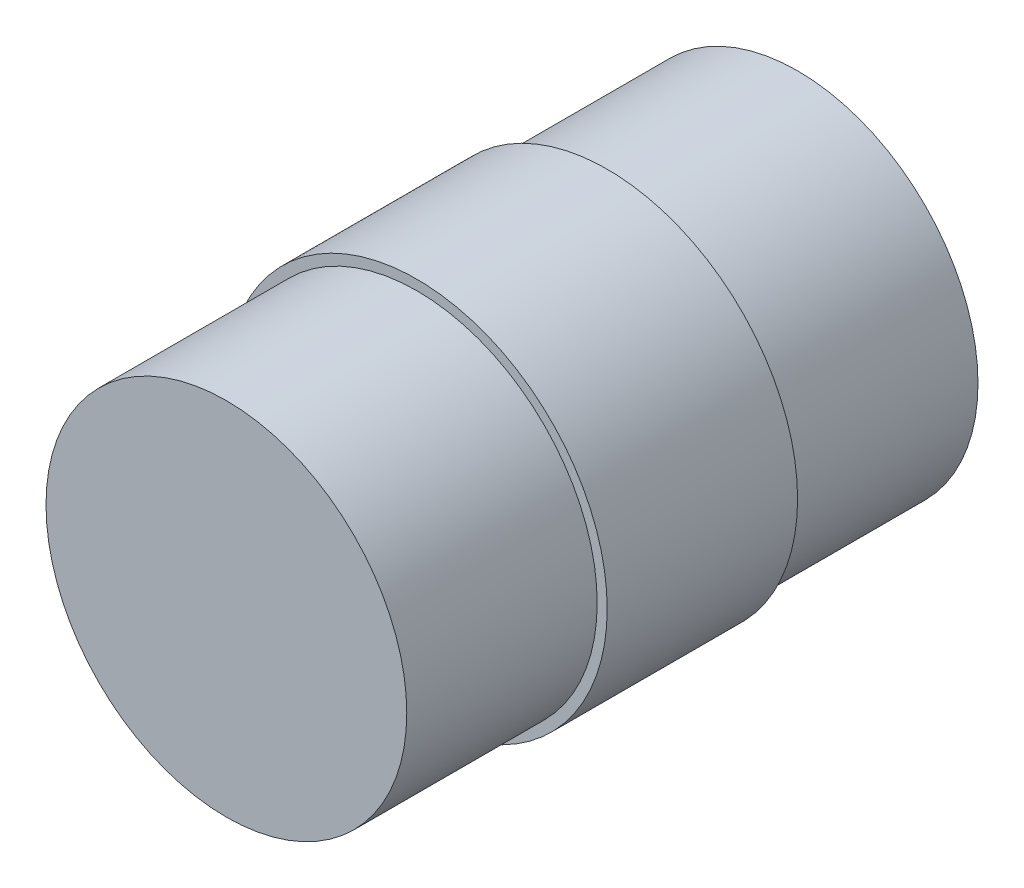
ISO-10303-21;
HEADER;
FILE_DESCRIPTION(('STEP AP214'),'2;1');
FILE_NAME('part.step','',(''),(''),'','','');
FILE_SCHEMA(('AUTOMOTIVE_DESIGN { 1 0 10303 214 1 1 1 1 }'));
ENDSEC;
DATA;
#1=APPLICATION_CONTEXT('core data for automotive mechanical design processes');
#2=APPLICATION_PROTOCOL_DEFINITION('international standard','automotive_design',2000,#1);
#3=PRODUCT_CONTEXT('',#1,'mechanical');
#4=PRODUCT('Part','Part','',(#3));
#5=PRODUCT_RELATED_PRODUCT_CATEGORY('part','',(#4));
#6=PRODUCT_DEFINITION_FORMATION('','',#4);
#7=PRODUCT_DEFINITION_CONTEXT('part definition',#1,'design');
#8=PRODUCT_DEFINITION('design','',#6,#7);
#9=PRODUCT_DEFINITION_SHAPE('','',#8);
#10=(LENGTH_UNIT() NAMED_UNIT(*) SI_UNIT(.MILLI.,.METRE.));
#11=(NAMED_UNIT(*) PLANE_ANGLE_UNIT() SI_UNIT($,.RADIAN.));
#12=(NAMED_UNIT(*) SI_UNIT($,.STERADIAN.) SOLID_ANGLE_UNIT());
#13=UNCERTAINTY_MEASURE_WITH_UNIT(LENGTH_MEASURE(1.E-05),#10,'distance_accuracy_value','');
#14=(GEOMETRIC_REPRESENTATION_CONTEXT(3) GLOBAL_UNCERTAINTY_ASSIGNED_CONTEXT((#13)) GLOBAL_UNIT_ASSIGNED_CONTEXT((#10,
#11,#12)) REPRESENTATION_CONTEXT('',''));
#15=CARTESIAN_POINT('',(0.,0.,0.));
#16=DIRECTION('',(0.,0.,1.));
#17=DIRECTION('',(1.,0.,0.));
#18=AXIS2_PLACEMENT_3D('',#15,#16,#17);
#19=CARTESIAN_POINT('',(0.,0.,19.));
#20=DIRECTION('',(0.,0.,1.));
#21=DIRECTION('',(1.,0.,0.));
#22=AXIS2_PLACEMENT_3D('',#19,#20,#21);
#23=PLANE('',#22);
#24=CARTESIAN_POINT('',(0.,0.,19.));
#25=DIRECTION('',(0.,0.,1.));
#26=DIRECTION('',(1.,0.,0.));
#27=AXIS2_PLACEMENT_3D('',#24,#25,#26);
#28=CIRCLE('',#27,19.);
#29=CARTESIAN_POINT('',(19.,0.,19.));
#30=VERTEX_POINT('',#29);
#31=EDGE_CURVE('E46',#30,#30,#28,.T.);
#32=ORIENTED_EDGE('',*,*,#31,.T.);
#33=EDGE_LOOP('',(#32));
#34=FACE_BOUND('',#33,.T.);
#35=CARTESIAN_POINT('',(0.,0.,19.));
#36=DIRECTION('',(0.,0.,1.));
#37=DIRECTION('',(1.,0.,0.));
#38=AXIS2_PLACEMENT_3D('',#35,#36,#37);
#39=CIRCLE('',#38,18.);
#40=CARTESIAN_POINT('',(18.,0.,19.));
#41=VERTEX_POINT('',#40);
#42=EDGE_CURVE('E55',#41,#41,#39,.T.);
#43=ORIENTED_EDGE('',*,*,#42,.F.);
#44=EDGE_LOOP('',(#43));
#45=FACE_BOUND('',#44,.T.);
#46=ADVANCED_FACE('F39',(#34,#45),#23,.T.);
#47=CARTESIAN_POINT('',(0.,0.,0.));
#48=DIRECTION('',(0.,0.,1.));
#49=DIRECTION('',(1.,0.,0.));
#50=AXIS2_PLACEMENT_3D('',#47,#48,#49);
#51=PLANE('',#50);
#52=CARTESIAN_POINT('',(0.,0.,0.));
#53=DIRECTION('',(0.,0.,1.));
#54=DIRECTION('',(1.,0.,0.));
#55=AXIS2_PLACEMENT_3D('',#52,#53,#54);
#56=CIRCLE('',#55,19.);
#57=CARTESIAN_POINT('',(19.,0.,0.));
#58=VERTEX_POINT('',#57);
#59=EDGE_CURVE('E50',#58,#58,#56,.T.);
#60=ORIENTED_EDGE('',*,*,#59,.F.);
#61=EDGE_LOOP('',(#60));
#62=FACE_BOUND('',#61,.T.);
#63=CARTESIAN_POINT('',(0.,0.,0.));
#64=DIRECTION('',(0.,0.,1.));
#65=DIRECTION('',(1.,0.,0.));
#66=AXIS2_PLACEMENT_3D('',#63,#64,#65);
#67=CIRCLE('',#66,18.);
#68=CARTESIAN_POINT('',(18.,0.,0.));
#69=VERTEX_POINT('',#68);
#70=EDGE_CURVE('E59',#69,#69,#67,.T.);
#71=ORIENTED_EDGE('',*,*,#70,.T.);
#72=EDGE_LOOP('',(#71));
#73=FACE_BOUND('',#72,.T.);
#74=ADVANCED_FACE('F87',(#62,#73),#51,.F.);
#75=CARTESIAN_POINT('',(0.,0.,19.));
#76=DIRECTION('',(0.,0.,-1.));
#77=DIRECTION('',(-1.,0.,0.));
#78=AXIS2_PLACEMENT_3D('',#75,#76,#77);
#79=CYLINDRICAL_SURFACE('',#78,19.);
#80=ORIENTED_EDGE('',*,*,#31,.F.);
#81=EDGE_LOOP('',(#80));
#82=FACE_BOUND('',#81,.T.);
#83=ORIENTED_EDGE('',*,*,#59,.T.);
#84=EDGE_LOOP('',(#83));
#85=FACE_BOUND('',#84,.T.);
#86=ADVANCED_FACE('F41',(#82,#85),#79,.T.);
#87=CARTESIAN_POINT('',(0.,0.,-19.));
#88=DIRECTION('',(0.,0.,1.));
#89=DIRECTION('',(1.,0.,0.));
#90=AXIS2_PLACEMENT_3D('',#87,#88,#89);
#91=PLANE('',#90);
#92=CARTESIAN_POINT('',(0.,0.,-19.));
#93=DIRECTION('',(0.,0.,1.));
#94=DIRECTION('',(1.,0.,0.));
#95=AXIS2_PLACEMENT_3D('',#92,#93,#94);
#96=CIRCLE('',#95,2.5);
#97=CARTESIAN_POINT('',(2.5,0.,-19.));
#98=VERTEX_POINT('',#97);
#99=EDGE_CURVE('E11',#98,#98,#96,.F.);
#100=ORIENTED_EDGE('',*,*,#99,.F.);
#101=EDGE_LOOP('',(#100));
#102=FACE_BOUND('',#101,.T.);
#103=CARTESIAN_POINT('',(0.,0.,-19.));
#104=DIRECTION('',(0.,0.,1.));
#105=DIRECTION('',(1.,0.,0.));
#106=AXIS2_PLACEMENT_3D('',#103,#104,#105);
#107=CIRCLE('',#106,18.);
#108=CARTESIAN_POINT('',(18.,0.,-19.));
#109=VERTEX_POINT('',#108);
#110=EDGE_CURVE('E62',#109,#109,#107,.T.);
#111=ORIENTED_EDGE('',*,*,#110,.F.);
#112=EDGE_LOOP('',(#111));
#113=FACE_BOUND('',#112,.T.);
#114=ADVANCED_FACE('F99',(#102,#113),#91,.F.);
#115=CARTESIAN_POINT('',(0.,0.,-19.));
#116=DIRECTION('',(0.,0.,1.));
#117=DIRECTION('',(1.,0.,0.));
#118=AXIS2_PLACEMENT_3D('',#115,#116,#117);
#119=CYLINDRICAL_SURFACE('',#118,18.);
#120=ORIENTED_EDGE('',*,*,#110,.T.);
#121=EDGE_LOOP('',(#120));
#122=FACE_BOUND('',#121,.T.);
#123=ORIENTED_EDGE('',*,*,#70,.F.);
#124=EDGE_LOOP('',(#123));
#125=FACE_BOUND('',#124,.T.);
#126=ADVANCED_FACE('F97',(#122,#125),#119,.T.);
#127=ORIENTED_EDGE('',*,*,#42,.T.);
#128=EDGE_LOOP('',(#127));
#129=FACE_BOUND('',#128,.T.);
#130=CARTESIAN_POINT('',(0.,0.,38.));
#131=DIRECTION('',(0.,0.,1.));
#132=DIRECTION('',(1.,0.,0.));
#133=AXIS2_PLACEMENT_3D('',#130,#131,#132);
#134=CIRCLE('',#133,18.);
#135=CARTESIAN_POINT('',(18.,0.,38.));
#136=VERTEX_POINT('',#135);
#137=EDGE_CURVE('E65',#136,#136,#134,.T.);
#138=ORIENTED_EDGE('',*,*,#137,.F.);
#139=EDGE_LOOP('',(#138));
#140=FACE_BOUND('',#139,.T.);
#141=ADVANCED_FACE('F83',(#129,#140),#119,.T.);
#142=CARTESIAN_POINT('',(0.,0.,38.));
#143=DIRECTION('',(0.,0.,1.));
#144=DIRECTION('',(1.,0.,0.));
#145=AXIS2_PLACEMENT_3D('',#142,#143,#144);
#146=PLANE('',#145);
#147=ORIENTED_EDGE('',*,*,#137,.T.);
#148=EDGE_LOOP('',(#147));
#149=FACE_BOUND('',#148,.T.);
#150=ADVANCED_FACE('F76',(#149),#146,.T.);
#151=CARTESIAN_POINT('',(0.,0.,-29.));
#152=DIRECTION('',(0.,0.,1.));
#153=DIRECTION('',(1.,0.,0.));
#154=AXIS2_PLACEMENT_3D('',#151,#152,#153);
#155=CYLINDRICAL_SURFACE('',#154,2.5);
#156=CARTESIAN_POINT('',(0.,0.,-29.));
#157=DIRECTION('',(0.,0.,-1.));
#158=DIRECTION('',(-1.,0.,0.));
#159=AXIS2_PLACEMENT_3D('',#156,#157,#158);
#160=CIRCLE('',#159,2.5);
#161=CARTESIAN_POINT('',(-2.5,0.,-29.));
#162=VERTEX_POINT('',#161);
#163=EDGE_CURVE('E68',#162,#162,#160,.T.);
#164=ORIENTED_EDGE('',*,*,#163,.F.);
#165=EDGE_LOOP('',(#164));
#166=FACE_BOUND('',#165,.T.);
#167=ORIENTED_EDGE('',*,*,#99,.T.);
#168=EDGE_LOOP('',(#167));
#169=FACE_BOUND('',#168,.T.);
#170=ADVANCED_FACE('F74',(#166,#169),#155,.T.);
#171=CARTESIAN_POINT('',(0.,0.,-29.));
#172=DIRECTION('',(0.,0.,-1.));
#173=DIRECTION('',(-1.,0.,0.));
#174=AXIS2_PLACEMENT_3D('',#171,#172,#173);
#175=PLANE('',#174);
#176=ORIENTED_EDGE('',*,*,#163,.T.);
#177=EDGE_LOOP('',(#176));
#178=FACE_BOUND('',#177,.T.);
#179=ADVANCED_FACE('F72',(#178),#175,.T.);
#180=CLOSED_SHELL('',(#46,#74,#86,#114,#126,#141,#150,#170,#179));
#181=MANIFOLD_SOLID_BREP('B2',#180);
#182=ADVANCED_BREP_SHAPE_REPRESENTATION('',(#18,#181),#14);
#183=SHAPE_DEFINITION_REPRESENTATION(#9,#182);
ENDSEC;
END-ISO-10303-21;
